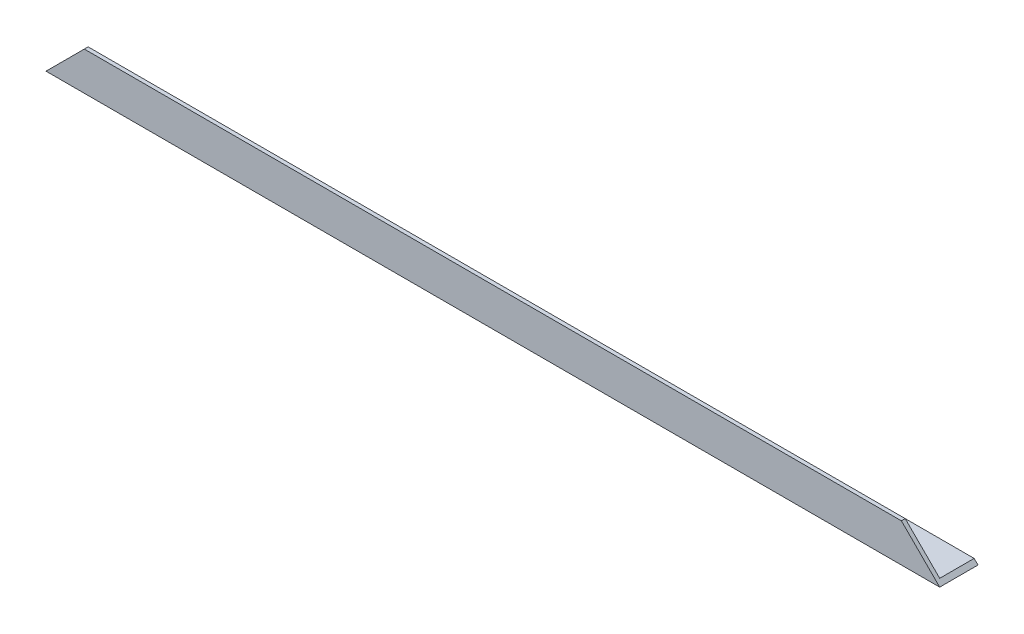
ISO-10303-21;
HEADER;
FILE_DESCRIPTION(('STEP AP214'),'2;1');
FILE_NAME('part.step','',(''),(''),'','','');
FILE_SCHEMA(('AUTOMOTIVE_DESIGN { 1 0 10303 214 1 1 1 1 }'));
ENDSEC;
DATA;
#1=APPLICATION_CONTEXT('core data for automotive mechanical design processes');
#2=APPLICATION_PROTOCOL_DEFINITION('international standard','automotive_design',2000,#1);
#3=PRODUCT_CONTEXT('',#1,'mechanical');
#4=PRODUCT('Part','Part','',(#3));
#5=PRODUCT_RELATED_PRODUCT_CATEGORY('part','',(#4));
#6=PRODUCT_DEFINITION_FORMATION('','',#4);
#7=PRODUCT_DEFINITION_CONTEXT('part definition',#1,'design');
#8=PRODUCT_DEFINITION('design','',#6,#7);
#9=PRODUCT_DEFINITION_SHAPE('','',#8);
#10=(LENGTH_UNIT() NAMED_UNIT(*) SI_UNIT(.MILLI.,.METRE.));
#11=(NAMED_UNIT(*) PLANE_ANGLE_UNIT() SI_UNIT($,.RADIAN.));
#12=(NAMED_UNIT(*) SI_UNIT($,.STERADIAN.) SOLID_ANGLE_UNIT());
#13=UNCERTAINTY_MEASURE_WITH_UNIT(LENGTH_MEASURE(1.E-05),#10,'distance_accuracy_value','');
#14=(GEOMETRIC_REPRESENTATION_CONTEXT(3) GLOBAL_UNCERTAINTY_ASSIGNED_CONTEXT((#13)) GLOBAL_UNIT_ASSIGNED_CONTEXT((#10,
#11,#12)) REPRESENTATION_CONTEXT('',''));
#15=CARTESIAN_POINT('',(0.,0.,0.));
#16=DIRECTION('',(0.,0.,1.));
#17=DIRECTION('',(1.,0.,0.));
#18=AXIS2_PLACEMENT_3D('',#15,#16,#17);
#19=CARTESIAN_POINT('',(350.,1.49999999999998,-15.));
#20=DIRECTION('',(0.,0.,1.));
#21=DIRECTION('',(1.,0.,0.));
#22=AXIS2_PLACEMENT_3D('',#19,#20,#21);
#23=PLANE('',#22);
#24=DIRECTION('',(-0.707106781186546,0.707106781186549,0.));
#25=VECTOR('',#24,1.);
#26=CARTESIAN_POINT('',(350.,0.,-15.));
#27=LINE('',#26,#25);
#28=CARTESIAN_POINT('',(350.,0.,-15.));
#29=VERTEX_POINT('',#28);
#30=CARTESIAN_POINT('',(348.5,1.49999999999998,-15.));
#31=VERTEX_POINT('',#30);
#32=EDGE_CURVE('E85',#29,#31,#27,.T.);
#33=ORIENTED_EDGE('',*,*,#32,.F.);
#34=DIRECTION('',(-1.,0.,0.));
#35=VECTOR('',#34,1.);
#36=CARTESIAN_POINT('',(350.,0.,-15.));
#37=LINE('',#36,#35);
#38=CARTESIAN_POINT('',(0.,0.,-15.));
#39=VERTEX_POINT('',#38);
#40=EDGE_CURVE('E11',#29,#39,#37,.T.);
#41=ORIENTED_EDGE('',*,*,#40,.T.);
#42=DIRECTION('',(0.707106781186546,0.707106781186549,0.));
#43=VECTOR('',#42,1.);
#44=CARTESIAN_POINT('',(0.,0.,-15.));
#45=LINE('',#44,#43);
#46=CARTESIAN_POINT('',(1.49999999999996,1.49999999999998,-15.));
#47=VERTEX_POINT('',#46);
#48=EDGE_CURVE('E121',#39,#47,#45,.T.);
#49=ORIENTED_EDGE('',*,*,#48,.T.);
#50=DIRECTION('',(-1.,0.,0.));
#51=VECTOR('',#50,1.);
#52=CARTESIAN_POINT('',(350.,1.49999999999998,-15.));
#53=LINE('',#52,#51);
#54=EDGE_CURVE('E44',#31,#47,#53,.T.);
#55=ORIENTED_EDGE('',*,*,#54,.F.);
#56=EDGE_LOOP('',(#33,#41,#49,#55));
#57=FACE_BOUND('',#56,.T.);
#58=ADVANCED_FACE('F35',(#57),#23,.F.);
#59=CARTESIAN_POINT('',(350.,1.5,-1.50000000000002));
#60=DIRECTION('',(0.,-1.,0.));
#61=DIRECTION('',(0.,0.,-1.));
#62=AXIS2_PLACEMENT_3D('',#59,#60,#61);
#63=PLANE('',#62);
#64=DIRECTION('',(0.,0.,1.));
#65=VECTOR('',#64,1.);
#66=CARTESIAN_POINT('',(348.5,1.5,-1.50000000000002));
#67=LINE('',#66,#65);
#68=CARTESIAN_POINT('',(348.5,1.5,-1.50000000000002));
#69=VERTEX_POINT('',#68);
#70=EDGE_CURVE('E118',#31,#69,#67,.T.);
#71=ORIENTED_EDGE('',*,*,#70,.F.);
#72=ORIENTED_EDGE('',*,*,#54,.T.);
#73=DIRECTION('',(0.,0.,1.));
#74=VECTOR('',#73,1.);
#75=CARTESIAN_POINT('',(1.5,1.5,-1.4999999999996));
#76=LINE('',#75,#74);
#77=CARTESIAN_POINT('',(1.5,1.50000000000003,-1.50000000000002));
#78=VERTEX_POINT('',#77);
#79=EDGE_CURVE('E102',#47,#78,#76,.T.);
#80=ORIENTED_EDGE('',*,*,#79,.T.);
#81=DIRECTION('',(-1.,0.,0.));
#82=VECTOR('',#81,1.);
#83=CARTESIAN_POINT('',(350.,1.5,-1.50000000000002));
#84=LINE('',#83,#82);
#85=EDGE_CURVE('E113',#69,#78,#84,.T.);
#86=ORIENTED_EDGE('',*,*,#85,.F.);
#87=EDGE_LOOP('',(#71,#72,#80,#86));
#88=FACE_BOUND('',#87,.T.);
#89=ADVANCED_FACE('F116',(#88),#63,.F.);
#90=CARTESIAN_POINT('',(350.,15.,-1.5));
#91=DIRECTION('',(0.,0.,1.));
#92=DIRECTION('',(0.,-1.,0.));
#93=AXIS2_PLACEMENT_3D('',#90,#91,#92);
#94=PLANE('',#93);
#95=DIRECTION('',(-0.707106781186546,0.707106781186549,0.));
#96=VECTOR('',#95,1.);
#97=CARTESIAN_POINT('',(342.5,7.50000000000002,-1.50000000000001));
#98=LINE('',#97,#96);
#99=CARTESIAN_POINT('',(335.,15.,-1.5));
#100=VERTEX_POINT('',#99);
#101=EDGE_CURVE('E137',#69,#100,#98,.T.);
#102=ORIENTED_EDGE('',*,*,#101,.F.);
#103=ORIENTED_EDGE('',*,*,#85,.T.);
#104=DIRECTION('',(0.707106781186546,0.707106781186549,0.));
#105=VECTOR('',#104,1.);
#106=CARTESIAN_POINT('',(182.499999999999,182.5,-1.49999999999973));
#107=LINE('',#106,#105);
#108=CARTESIAN_POINT('',(14.9999999999999,15.,-1.5));
#109=VERTEX_POINT('',#108);
#110=EDGE_CURVE('E105',#78,#109,#107,.T.);
#111=ORIENTED_EDGE('',*,*,#110,.T.);
#112=DIRECTION('',(-1.,0.,0.));
#113=VECTOR('',#112,1.);
#114=CARTESIAN_POINT('',(350.,15.,-1.5));
#115=LINE('',#114,#113);
#116=EDGE_CURVE('E111',#100,#109,#115,.T.);
#117=ORIENTED_EDGE('',*,*,#116,.F.);
#118=EDGE_LOOP('',(#102,#103,#111,#117));
#119=FACE_BOUND('',#118,.T.);
#120=ADVANCED_FACE('F136',(#119),#94,.F.);
#121=CARTESIAN_POINT('',(350.,15.,0.));
#122=DIRECTION('',(0.,-1.,0.));
#123=DIRECTION('',(0.,0.,-1.));
#124=AXIS2_PLACEMENT_3D('',#121,#122,#123);
#125=PLANE('',#124);
#126=DIRECTION('',(0.,0.,1.));
#127=VECTOR('',#126,1.);
#128=CARTESIAN_POINT('',(335.,15.,0.));
#129=LINE('',#128,#127);
#130=CARTESIAN_POINT('',(335.,15.,0.));
#131=VERTEX_POINT('',#130);
#132=EDGE_CURVE('E97',#100,#131,#129,.T.);
#133=ORIENTED_EDGE('',*,*,#132,.F.);
#134=ORIENTED_EDGE('',*,*,#116,.T.);
#135=DIRECTION('',(0.,0.,1.));
#136=VECTOR('',#135,1.);
#137=CARTESIAN_POINT('',(14.9999999999999,15.,0.));
#138=LINE('',#137,#136);
#139=CARTESIAN_POINT('',(14.9999999999999,15.,0.));
#140=VERTEX_POINT('',#139);
#141=EDGE_CURVE('E124',#109,#140,#138,.T.);
#142=ORIENTED_EDGE('',*,*,#141,.T.);
#143=DIRECTION('',(-1.,0.,0.));
#144=VECTOR('',#143,1.);
#145=CARTESIAN_POINT('',(350.,15.,0.));
#146=LINE('',#145,#144);
#147=EDGE_CURVE('E109',#131,#140,#146,.T.);
#148=ORIENTED_EDGE('',*,*,#147,.F.);
#149=EDGE_LOOP('',(#133,#134,#142,#148));
#150=FACE_BOUND('',#149,.T.);
#151=ADVANCED_FACE('F145',(#150),#125,.F.);
#152=CARTESIAN_POINT('',(350.,0.,0.));
#153=DIRECTION('',(0.,0.,-1.));
#154=DIRECTION('',(-1.,0.,0.));
#155=AXIS2_PLACEMENT_3D('',#152,#153,#154);
#156=PLANE('',#155);
#157=DIRECTION('',(-0.707106781186546,0.707106781186549,0.));
#158=VECTOR('',#157,1.);
#159=CARTESIAN_POINT('',(350.,0.,0.));
#160=LINE('',#159,#158);
#161=CARTESIAN_POINT('',(350.,0.,0.));
#162=VERTEX_POINT('',#161);
#163=EDGE_CURVE('E50',#162,#131,#160,.T.);
#164=ORIENTED_EDGE('',*,*,#163,.T.);
#165=ORIENTED_EDGE('',*,*,#147,.T.);
#166=DIRECTION('',(0.707106781186546,0.707106781186549,0.));
#167=VECTOR('',#166,1.);
#168=CARTESIAN_POINT('',(0.,0.,0.));
#169=LINE('',#168,#167);
#170=CARTESIAN_POINT('',(0.,0.,0.));
#171=VERTEX_POINT('',#170);
#172=EDGE_CURVE('E125',#171,#140,#169,.T.);
#173=ORIENTED_EDGE('',*,*,#172,.F.);
#174=DIRECTION('',(-1.,0.,0.));
#175=VECTOR('',#174,1.);
#176=CARTESIAN_POINT('',(350.,0.,0.));
#177=LINE('',#176,#175);
#178=EDGE_CURVE('E90',#162,#171,#177,.T.);
#179=ORIENTED_EDGE('',*,*,#178,.F.);
#180=EDGE_LOOP('',(#164,#165,#173,#179));
#181=FACE_BOUND('',#180,.T.);
#182=ADVANCED_FACE('F143',(#181),#156,.F.);
#183=CARTESIAN_POINT('',(350.,0.,-15.));
#184=DIRECTION('',(0.,1.,0.));
#185=DIRECTION('',(0.,0.,1.));
#186=AXIS2_PLACEMENT_3D('',#183,#184,#185);
#187=PLANE('',#186);
#188=DIRECTION('',(0.,0.,-1.));
#189=VECTOR('',#188,1.);
#190=CARTESIAN_POINT('',(0.,0.,-15.));
#191=LINE('',#190,#189);
#192=EDGE_CURVE('E91',#171,#39,#191,.T.);
#193=ORIENTED_EDGE('',*,*,#192,.T.);
#194=ORIENTED_EDGE('',*,*,#40,.F.);
#195=DIRECTION('',(0.,0.,-1.));
#196=VECTOR('',#195,1.);
#197=CARTESIAN_POINT('',(350.,0.,-15.));
#198=LINE('',#197,#196);
#199=EDGE_CURVE('E82',#162,#29,#198,.T.);
#200=ORIENTED_EDGE('',*,*,#199,.F.);
#201=ORIENTED_EDGE('',*,*,#178,.T.);
#202=EDGE_LOOP('',(#193,#194,#200,#201));
#203=FACE_BOUND('',#202,.T.);
#204=ADVANCED_FACE('F37',(#203),#187,.F.);
#205=CARTESIAN_POINT('',(0.,0.,-15.));
#206=DIRECTION('',(0.707106781186549,-0.707106781186546,0.));
#207=DIRECTION('',(0.707106781186546,0.707106781186549,0.));
#208=AXIS2_PLACEMENT_3D('',#205,#206,#207);
#209=PLANE('',#208);
#210=ORIENTED_EDGE('',*,*,#48,.F.);
#211=ORIENTED_EDGE('',*,*,#192,.F.);
#212=ORIENTED_EDGE('',*,*,#172,.T.);
#213=ORIENTED_EDGE('',*,*,#141,.F.);
#214=ORIENTED_EDGE('',*,*,#110,.F.);
#215=ORIENTED_EDGE('',*,*,#79,.F.);
#216=EDGE_LOOP('',(#210,#211,#212,#213,#214,#215));
#217=FACE_BOUND('',#216,.T.);
#218=ADVANCED_FACE('F120',(#217),#209,.F.);
#219=CARTESIAN_POINT('',(350.,0.,-15.));
#220=DIRECTION('',(0.707106781186549,0.707106781186546,0.));
#221=DIRECTION('',(-0.707106781186546,0.707106781186549,0.));
#222=AXIS2_PLACEMENT_3D('',#219,#220,#221);
#223=PLANE('',#222);
#224=ORIENTED_EDGE('',*,*,#70,.T.);
#225=ORIENTED_EDGE('',*,*,#101,.T.);
#226=ORIENTED_EDGE('',*,*,#132,.T.);
#227=ORIENTED_EDGE('',*,*,#163,.F.);
#228=ORIENTED_EDGE('',*,*,#199,.T.);
#229=ORIENTED_EDGE('',*,*,#32,.T.);
#230=EDGE_LOOP('',(#224,#225,#226,#227,#228,#229));
#231=FACE_BOUND('',#230,.T.);
#232=ADVANCED_FACE('F84',(#231),#223,.T.);
#233=CLOSED_SHELL('',(#58,#89,#120,#151,#182,#204,#218,#232));
#234=MANIFOLD_SOLID_BREP('B2',#233);
#235=ADVANCED_BREP_SHAPE_REPRESENTATION('',(#18,#234),#14);
#236=SHAPE_DEFINITION_REPRESENTATION(#9,#235);
ENDSEC;
END-ISO-10303-21;
